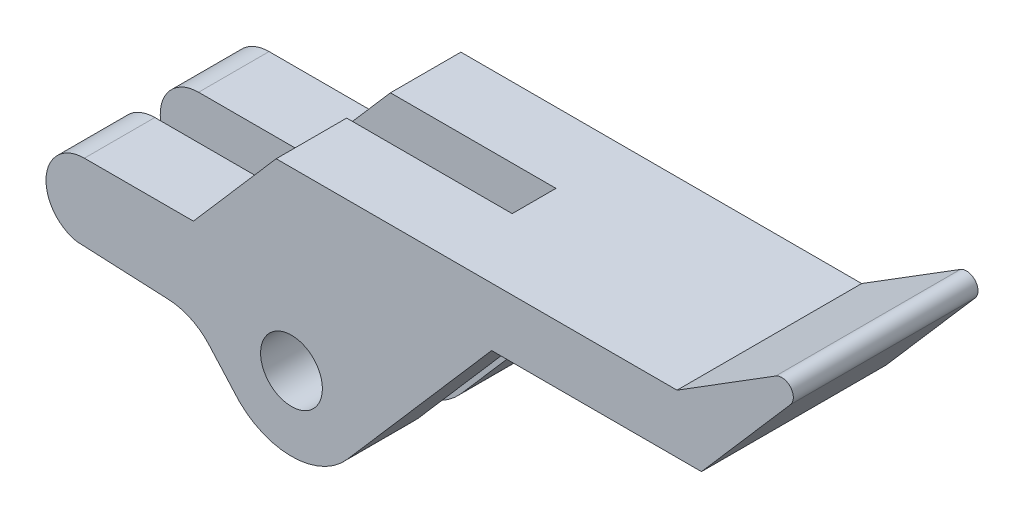
ISO-10303-21;
HEADER;
FILE_DESCRIPTION(('STEP AP214'),'2;1');
FILE_NAME('part.step','',(''),(''),'','','');
FILE_SCHEMA(('AUTOMOTIVE_DESIGN { 1 0 10303 214 1 1 1 1 }'));
ENDSEC;
DATA;
#1=APPLICATION_CONTEXT('core data for automotive mechanical design processes');
#2=APPLICATION_PROTOCOL_DEFINITION('international standard','automotive_design',2000,#1);
#3=PRODUCT_CONTEXT('',#1,'mechanical');
#4=PRODUCT('Part','Part','',(#3));
#5=PRODUCT_RELATED_PRODUCT_CATEGORY('part','',(#4));
#6=PRODUCT_DEFINITION_FORMATION('','',#4);
#7=PRODUCT_DEFINITION_CONTEXT('part definition',#1,'design');
#8=PRODUCT_DEFINITION('design','',#6,#7);
#9=PRODUCT_DEFINITION_SHAPE('','',#8);
#10=(LENGTH_UNIT() NAMED_UNIT(*) SI_UNIT(.MILLI.,.METRE.));
#11=(NAMED_UNIT(*) PLANE_ANGLE_UNIT() SI_UNIT($,.RADIAN.));
#12=(NAMED_UNIT(*) SI_UNIT($,.STERADIAN.) SOLID_ANGLE_UNIT());
#13=UNCERTAINTY_MEASURE_WITH_UNIT(LENGTH_MEASURE(1.E-05),#10,'distance_accuracy_value','');
#14=(GEOMETRIC_REPRESENTATION_CONTEXT(3) GLOBAL_UNCERTAINTY_ASSIGNED_CONTEXT((#13)) GLOBAL_UNIT_ASSIGNED_CONTEXT((#10,
#11,#12)) REPRESENTATION_CONTEXT('',''));
#15=CARTESIAN_POINT('',(0.,0.,0.));
#16=DIRECTION('',(0.,0.,1.));
#17=DIRECTION('',(1.,0.,0.));
#18=AXIS2_PLACEMENT_3D('',#15,#16,#17);
#19=CARTESIAN_POINT('',(-25.1917416131223,-4.97044105303234,9.62));
#20=DIRECTION('',(0.755386178272393,-0.655279880413728,0.));
#21=DIRECTION('',(0.655279880413728,0.755386178272393,0.));
#22=AXIS2_PLACEMENT_3D('',#19,#20,#21);
#23=PLANE('',#22);
#24=DIRECTION('',(0.,0.,-1.));
#25=VECTOR('',#24,1.);
#26=CARTESIAN_POINT('',(-20.88,0.,9.62));
#27=LINE('',#26,#25);
#28=CARTESIAN_POINT('',(-20.88,0.,9.62));
#29=VERTEX_POINT('',#28);
#30=CARTESIAN_POINT('',(-20.88,0.,5.95));
#31=VERTEX_POINT('',#30);
#32=EDGE_CURVE('E11',#29,#31,#27,.T.);
#33=ORIENTED_EDGE('',*,*,#32,.T.);
#34=DIRECTION('',(-0.655279880413728,-0.755386178272393,0.));
#35=VECTOR('',#34,1.);
#36=CARTESIAN_POINT('',(-25.1917416131223,-4.97044105303234,5.95));
#37=LINE('',#36,#35);
#38=CARTESIAN_POINT('',(-25.1917416131223,-4.97044105303234,5.95));
#39=VERTEX_POINT('',#38);
#40=EDGE_CURVE('E348',#31,#39,#37,.T.);
#41=ORIENTED_EDGE('',*,*,#40,.T.);
#42=DIRECTION('',(0.,0.,-1.));
#43=VECTOR('',#42,1.);
#44=CARTESIAN_POINT('',(-25.1917416131223,-4.97044105303234,9.62));
#45=LINE('',#44,#43);
#46=CARTESIAN_POINT('',(-25.1917416131223,-4.97044105303234,9.62));
#47=VERTEX_POINT('',#46);
#48=EDGE_CURVE('E277',#47,#39,#45,.T.);
#49=ORIENTED_EDGE('',*,*,#48,.F.);
#50=DIRECTION('',(-0.655279880413728,-0.755386178272393,0.));
#51=VECTOR('',#50,1.);
#52=CARTESIAN_POINT('',(-25.1917416131223,-4.97044105303234,9.62));
#53=LINE('',#52,#51);
#54=EDGE_CURVE('E123',#29,#47,#53,.T.);
#55=ORIENTED_EDGE('',*,*,#54,.F.);
#56=EDGE_LOOP('',(#33,#41,#49,#55));
#57=FACE_BOUND('',#56,.T.);
#58=ADVANCED_FACE('F41',(#57),#23,.F.);
#59=CARTESIAN_POINT('',(-30.8717416131223,-4.97044105303234,9.62));
#60=DIRECTION('',(0.,-1.,0.));
#61=DIRECTION('',(1.,0.,0.));
#62=AXIS2_PLACEMENT_3D('',#59,#60,#61);
#63=PLANE('',#62);
#64=ORIENTED_EDGE('',*,*,#48,.T.);
#65=DIRECTION('',(-1.,0.,0.));
#66=VECTOR('',#65,1.);
#67=CARTESIAN_POINT('',(-30.8717416131223,-4.97044105303234,5.95));
#68=LINE('',#67,#66);
#69=CARTESIAN_POINT('',(-30.8717416131223,-4.97044105303234,5.95));
#70=VERTEX_POINT('',#69);
#71=EDGE_CURVE('E344',#39,#70,#68,.T.);
#72=ORIENTED_EDGE('',*,*,#71,.T.);
#73=DIRECTION('',(0.,0.,-1.));
#74=VECTOR('',#73,1.);
#75=CARTESIAN_POINT('',(-30.8717416131223,-4.97044105303234,9.62));
#76=LINE('',#75,#74);
#77=CARTESIAN_POINT('',(-30.8717416131223,-4.97044105303234,9.62));
#78=VERTEX_POINT('',#77);
#79=EDGE_CURVE('E272',#78,#70,#76,.T.);
#80=ORIENTED_EDGE('',*,*,#79,.F.);
#81=DIRECTION('',(-1.,0.,0.));
#82=VECTOR('',#81,1.);
#83=CARTESIAN_POINT('',(-30.8717416131223,-4.97044105303234,9.62));
#84=LINE('',#83,#82);
#85=EDGE_CURVE('E363',#47,#78,#84,.T.);
#86=ORIENTED_EDGE('',*,*,#85,.F.);
#87=EDGE_LOOP('',(#64,#72,#80,#86));
#88=FACE_BOUND('',#87,.T.);
#89=ADVANCED_FACE('F407',(#88),#63,.F.);
#90=CARTESIAN_POINT('',(-30.8717416131223,-6.97044105303234,9.62));
#91=DIRECTION('',(0.,0.,-1.));
#92=DIRECTION('',(-1.,0.,0.));
#93=AXIS2_PLACEMENT_3D('',#90,#91,#92);
#94=CYLINDRICAL_SURFACE('',#93,2.);
#95=ORIENTED_EDGE('',*,*,#79,.T.);
#96=CARTESIAN_POINT('',(-30.8717416131223,-6.97044105303234,5.95));
#97=DIRECTION('',(0.,0.,1.));
#98=DIRECTION('',(0.,-1.,0.));
#99=AXIS2_PLACEMENT_3D('',#96,#97,#98);
#100=CIRCLE('',#99,2.);
#101=CARTESIAN_POINT('',(-31.2856587952111,-8.92714045927023,5.95));
#102=VERTEX_POINT('',#101);
#103=EDGE_CURVE('E340',#70,#102,#100,.T.);
#104=ORIENTED_EDGE('',*,*,#103,.T.);
#105=DIRECTION('',(0.,0.,-1.));
#106=VECTOR('',#105,1.);
#107=CARTESIAN_POINT('',(-31.2856587952111,-8.92714045927023,9.62));
#108=LINE('',#107,#106);
#109=CARTESIAN_POINT('',(-31.2856587952111,-8.92714045927023,9.62));
#110=VERTEX_POINT('',#109);
#111=EDGE_CURVE('E267',#110,#102,#108,.T.);
#112=ORIENTED_EDGE('',*,*,#111,.F.);
#113=CARTESIAN_POINT('',(-30.8717416131223,-6.97044105303234,9.62));
#114=DIRECTION('',(0.,0.,1.));
#115=DIRECTION('',(-1.,0.,0.));
#116=AXIS2_PLACEMENT_3D('',#113,#114,#115);
#117=CIRCLE('',#116,2.);
#118=EDGE_CURVE('E366',#78,#110,#117,.T.);
#119=ORIENTED_EDGE('',*,*,#118,.F.);
#120=EDGE_LOOP('',(#95,#104,#112,#119));
#121=FACE_BOUND('',#120,.T.);
#122=ADVANCED_FACE('F412',(#121),#94,.T.);
#123=CARTESIAN_POINT('',(-31.2856587952111,-8.92714045927023,9.62));
#124=DIRECTION('',(0.0468353778050424,0.998902621573224,0.));
#125=DIRECTION('',(-0.998902621573224,0.0468353778050424,0.));
#126=AXIS2_PLACEMENT_3D('',#123,#124,#125);
#127=PLANE('',#126);
#128=ORIENTED_EDGE('',*,*,#111,.T.);
#129=DIRECTION('',(0.998902621573224,-0.0468353778050424,0.));
#130=VECTOR('',#129,1.);
#131=CARTESIAN_POINT('',(-31.2856587952111,-8.92714045927023,5.95));
#132=LINE('',#131,#130);
#133=CARTESIAN_POINT('',(-26.4703643199752,-9.15291435466257,5.95));
#134=VERTEX_POINT('',#133);
#135=EDGE_CURVE('E336',#102,#134,#132,.T.);
#136=ORIENTED_EDGE('',*,*,#135,.T.);
#137=DIRECTION('',(0.,0.,-1.));
#138=VECTOR('',#137,1.);
#139=CARTESIAN_POINT('',(-26.4703643199752,-9.15291435466257,9.62));
#140=LINE('',#139,#138);
#141=CARTESIAN_POINT('',(-26.4703643199752,-9.15291435466257,9.62));
#142=VERTEX_POINT('',#141);
#143=EDGE_CURVE('E262',#142,#134,#140,.T.);
#144=ORIENTED_EDGE('',*,*,#143,.F.);
#145=DIRECTION('',(0.998902621573224,-0.0468353778050423,0.));
#146=VECTOR('',#145,1.);
#147=CARTESIAN_POINT('',(-31.2856587952111,-8.92714045927023,9.62));
#148=LINE('',#147,#146);
#149=EDGE_CURVE('E369',#110,#142,#148,.T.);
#150=ORIENTED_EDGE('',*,*,#149,.F.);
#151=EDGE_LOOP('',(#128,#136,#144,#150));
#152=FACE_BOUND('',#151,.T.);
#153=ADVANCED_FACE('F485',(#152),#127,.F.);
#154=CARTESIAN_POINT('',(-26.6108704533903,-12.1496222193822,9.62));
#155=DIRECTION('',(0.,0.,-1.));
#156=DIRECTION('',(-1.,0.,0.));
#157=AXIS2_PLACEMENT_3D('',#154,#155,#156);
#158=CYLINDRICAL_SURFACE('',#157,3.);
#159=ORIENTED_EDGE('',*,*,#143,.T.);
#160=CARTESIAN_POINT('',(-26.6108704533903,-12.1496222193822,5.95));
#161=DIRECTION('',(0.,0.,1.));
#162=DIRECTION('',(0.,-1.,0.));
#163=AXIS2_PLACEMENT_3D('',#160,#161,#162);
#164=CIRCLE('',#163,3.);
#165=CARTESIAN_POINT('',(-24.3701775872998,-10.1548050648914,5.95));
#166=VERTEX_POINT('',#165);
#167=EDGE_CURVE('E332',#134,#166,#164,.F.);
#168=ORIENTED_EDGE('',*,*,#167,.T.);
#169=DIRECTION('',(0.,0.,-1.));
#170=VECTOR('',#169,1.);
#171=CARTESIAN_POINT('',(-24.3701775872998,-10.1548050648914,9.62));
#172=LINE('',#171,#170);
#173=CARTESIAN_POINT('',(-24.3701775872998,-10.1548050648914,9.62));
#174=VERTEX_POINT('',#173);
#175=EDGE_CURVE('E257',#174,#166,#172,.T.);
#176=ORIENTED_EDGE('',*,*,#175,.F.);
#177=CARTESIAN_POINT('',(-26.6108704533903,-12.1496222193822,9.62));
#178=DIRECTION('',(0.,0.,-1.));
#179=DIRECTION('',(-1.,0.,0.));
#180=AXIS2_PLACEMENT_3D('',#177,#178,#179);
#181=CIRCLE('',#180,3.);
#182=EDGE_CURVE('E372',#142,#174,#181,.T.);
#183=ORIENTED_EDGE('',*,*,#182,.F.);
#184=EDGE_LOOP('',(#159,#168,#176,#183));
#185=FACE_BOUND('',#184,.T.);
#186=ADVANCED_FACE('F489',(#185),#158,.F.);
#187=CARTESIAN_POINT('',(-23.081545029954,-11.6022709500511,9.62));
#188=DIRECTION('',(0.746897622030191,0.664939051496937,0.));
#189=DIRECTION('',(-0.664939051496937,0.746897622030191,0.));
#190=AXIS2_PLACEMENT_3D('',#187,#188,#189);
#191=PLANE('',#190);
#192=ORIENTED_EDGE('',*,*,#175,.T.);
#193=DIRECTION('',(0.664939051496937,-0.746897622030191,0.));
#194=VECTOR('',#193,1.);
#195=CARTESIAN_POINT('',(-23.081545029954,-11.6022709500511,5.95));
#196=LINE('',#195,#194);
#197=CARTESIAN_POINT('',(-23.081545029954,-11.6022709500511,5.95));
#198=VERTEX_POINT('',#197);
#199=EDGE_CURVE('E328',#166,#198,#196,.T.);
#200=ORIENTED_EDGE('',*,*,#199,.T.);
#201=DIRECTION('',(0.,0.,-1.));
#202=VECTOR('',#201,1.);
#203=CARTESIAN_POINT('',(-23.081545029954,-11.6022709500511,9.62));
#204=LINE('',#203,#202);
#205=CARTESIAN_POINT('',(-23.081545029954,-11.6022709500511,9.62));
#206=VERTEX_POINT('',#205);
#207=EDGE_CURVE('E252',#206,#198,#204,.T.);
#208=ORIENTED_EDGE('',*,*,#207,.F.);
#209=DIRECTION('',(0.664939051496937,-0.746897622030191,0.));
#210=VECTOR('',#209,1.);
#211=CARTESIAN_POINT('',(-23.081545029954,-11.6022709500511,9.62));
#212=LINE('',#211,#210);
#213=EDGE_CURVE('E375',#174,#206,#212,.T.);
#214=ORIENTED_EDGE('',*,*,#213,.F.);
#215=EDGE_LOOP('',(#192,#200,#208,#214));
#216=FACE_BOUND('',#215,.T.);
#217=ADVANCED_FACE('F495',(#216),#191,.F.);
#218=CARTESIAN_POINT('',(-20.0842699298777,-9.17,9.62));
#219=DIRECTION('',(0.,0.,-1.));
#220=DIRECTION('',(-1.,0.,0.));
#221=AXIS2_PLACEMENT_3D('',#218,#219,#220);
#222=CYLINDRICAL_SURFACE('',#221,3.86);
#223=ORIENTED_EDGE('',*,*,#207,.T.);
#224=CARTESIAN_POINT('',(-20.0842699298777,-9.17,5.95));
#225=DIRECTION('',(0.,0.,1.));
#226=DIRECTION('',(0.,-1.,0.));
#227=AXIS2_PLACEMENT_3D('',#224,#225,#226);
#228=CIRCLE('',#227,3.86);
#229=CARTESIAN_POINT('',(-17.1684792817462,-11.699380338397,5.95));
#230=VERTEX_POINT('',#229);
#231=EDGE_CURVE('E324',#198,#230,#228,.T.);
#232=ORIENTED_EDGE('',*,*,#231,.T.);
#233=DIRECTION('',(0.,0.,-1.));
#234=VECTOR('',#233,1.);
#235=CARTESIAN_POINT('',(-17.1684792817462,-11.699380338397,9.62));
#236=LINE('',#235,#234);
#237=CARTESIAN_POINT('',(-17.1684792817462,-11.699380338397,9.62));
#238=VERTEX_POINT('',#237);
#239=EDGE_CURVE('E247',#238,#230,#236,.T.);
#240=ORIENTED_EDGE('',*,*,#239,.F.);
#241=CARTESIAN_POINT('',(-20.0842699298777,-9.17,9.62));
#242=DIRECTION('',(0.,0.,1.));
#243=DIRECTION('',(1.,0.,0.));
#244=AXIS2_PLACEMENT_3D('',#241,#242,#243);
#245=CIRCLE('',#244,3.86);
#246=EDGE_CURVE('E378',#206,#238,#245,.T.);
#247=ORIENTED_EDGE('',*,*,#246,.F.);
#248=EDGE_LOOP('',(#223,#232,#240,#247));
#249=FACE_BOUND('',#248,.T.);
#250=ADVANCED_FACE('F501',(#249),#222,.T.);
#251=CARTESIAN_POINT('',(-9.65666893120579,-3.04,9.62));
#252=DIRECTION('',(-0.755386178272393,0.655279880413727,0.));
#253=DIRECTION('',(-0.655279880413727,-0.755386178272393,0.));
#254=AXIS2_PLACEMENT_3D('',#251,#252,#253);
#255=PLANE('',#254);
#256=ORIENTED_EDGE('',*,*,#239,.T.);
#257=DIRECTION('',(-0.655279880413727,-0.755386178272393,0.));
#258=VECTOR('',#257,1.);
#259=CARTESIAN_POINT('',(-9.65666893120579,-3.04,5.95));
#260=LINE('',#259,#258);
#261=CARTESIAN_POINT('',(-9.65666893120579,-3.04,5.95));
#262=VERTEX_POINT('',#261);
#263=EDGE_CURVE('E295',#262,#230,#260,.T.);
#264=ORIENTED_EDGE('',*,*,#263,.F.);
#265=DIRECTION('',(0.,0.,-1.));
#266=VECTOR('',#265,1.);
#267=CARTESIAN_POINT('',(-9.65666893120579,-3.04,9.62));
#268=LINE('',#267,#266);
#269=CARTESIAN_POINT('',(-9.65666893120579,-3.04,9.62));
#270=VERTEX_POINT('',#269);
#271=EDGE_CURVE('E242',#270,#262,#268,.T.);
#272=ORIENTED_EDGE('',*,*,#271,.F.);
#273=DIRECTION('',(0.655279880413727,0.755386178272393,0.));
#274=VECTOR('',#273,1.);
#275=CARTESIAN_POINT('',(-9.65666893120579,-3.04,9.62));
#276=LINE('',#275,#274);
#277=EDGE_CURVE('E381',#238,#270,#276,.T.);
#278=ORIENTED_EDGE('',*,*,#277,.F.);
#279=EDGE_LOOP('',(#256,#264,#272,#278));
#280=FACE_BOUND('',#279,.T.);
#281=ADVANCED_FACE('F394',(#280),#255,.F.);
#282=CARTESIAN_POINT('',(-20.0842699298777,-9.17,9.62));
#283=DIRECTION('',(0.,0.,-1.));
#284=DIRECTION('',(-1.,0.,0.));
#285=AXIS2_PLACEMENT_3D('',#282,#283,#284);
#286=CYLINDRICAL_SURFACE('',#285,1.61);
#287=CARTESIAN_POINT('',(-20.0842699298777,-9.17,5.95));
#288=DIRECTION('',(0.,0.,1.));
#289=DIRECTION('',(0.,-1.,0.));
#290=AXIS2_PLACEMENT_3D('',#287,#288,#289);
#291=CIRCLE('',#290,1.61);
#292=CARTESIAN_POINT('',(-20.0842699298777,-10.78,5.95));
#293=VERTEX_POINT('',#292);
#294=EDGE_CURVE('E45',#293,#293,#291,.T.);
#295=ORIENTED_EDGE('',*,*,#294,.F.);
#296=EDGE_LOOP('',(#295));
#297=FACE_BOUND('',#296,.T.);
#298=CARTESIAN_POINT('',(-20.0842699298777,-9.17,9.62));
#299=DIRECTION('',(0.,0.,1.));
#300=DIRECTION('',(1.,0.,0.));
#301=AXIS2_PLACEMENT_3D('',#298,#299,#300);
#302=CIRCLE('',#301,1.61);
#303=CARTESIAN_POINT('',(-18.4742699298777,-9.17,9.62));
#304=VERTEX_POINT('',#303);
#305=EDGE_CURVE('E192',#304,#304,#302,.T.);
#306=ORIENTED_EDGE('',*,*,#305,.T.);
#307=EDGE_LOOP('',(#306));
#308=FACE_BOUND('',#307,.T.);
#309=ADVANCED_FACE('F391',(#297,#308),#286,.F.);
#310=CARTESIAN_POINT('',(5.4583513994612,2.7,9.62));
#311=DIRECTION('',(0.,0.,-1.));
#312=DIRECTION('',(-1.,0.,0.));
#313=AXIS2_PLACEMENT_3D('',#310,#311,#312);
#314=PLANE('',#313);
#315=DIRECTION('',(-1.,0.,0.));
#316=VECTOR('',#315,1.);
#317=CARTESIAN_POINT('',(-20.88,0.,9.62));
#318=LINE('',#317,#316);
#319=CARTESIAN_POINT('',(0.,0.,9.62));
#320=VERTEX_POINT('',#319);
#321=EDGE_CURVE('E234',#320,#29,#318,.T.);
#322=ORIENTED_EDGE('',*,*,#321,.T.);
#323=ORIENTED_EDGE('',*,*,#54,.T.);
#324=ORIENTED_EDGE('',*,*,#85,.T.);
#325=ORIENTED_EDGE('',*,*,#118,.T.);
#326=ORIENTED_EDGE('',*,*,#149,.T.);
#327=ORIENTED_EDGE('',*,*,#182,.T.);
#328=ORIENTED_EDGE('',*,*,#213,.T.);
#329=ORIENTED_EDGE('',*,*,#246,.T.);
#330=ORIENTED_EDGE('',*,*,#277,.T.);
#331=DIRECTION('',(1.,0.,0.));
#332=VECTOR('',#331,1.);
#333=CARTESIAN_POINT('',(1.27333106879422,-3.04,9.62));
#334=LINE('',#333,#332);
#335=CARTESIAN_POINT('',(1.27333106879422,-3.04,9.62));
#336=VERTEX_POINT('',#335);
#337=EDGE_CURVE('E162',#270,#336,#334,.T.);
#338=ORIENTED_EDGE('',*,*,#337,.T.);
#339=DIRECTION('',(0.655279880413727,0.755386178272393,0.));
#340=VECTOR('',#339,1.);
#341=CARTESIAN_POINT('',(5.91158310642463,2.30683207175176,9.62));
#342=LINE('',#341,#340);
#343=CARTESIAN_POINT('',(5.91158310642463,2.30683207175176,9.62));
#344=VERTEX_POINT('',#343);
#345=EDGE_CURVE('E154',#336,#344,#342,.T.);
#346=ORIENTED_EDGE('',*,*,#345,.T.);
#347=CARTESIAN_POINT('',(5.4583513994612,2.7,9.62));
#348=DIRECTION('',(0.,0.,1.));
#349=DIRECTION('',(-1.,0.,0.));
#350=AXIS2_PLACEMENT_3D('',#347,#348,#349);
#351=CIRCLE('',#350,0.599999999999999);
#352=CARTESIAN_POINT('',(5.14063126161573,3.20897339223918,9.62));
#353=VERTEX_POINT('',#352);
#354=EDGE_CURVE('E159',#344,#353,#351,.T.);
#355=ORIENTED_EDGE('',*,*,#354,.T.);
#356=DIRECTION('',(-0.848288987065303,-0.529533563075772,0.));
#357=VECTOR('',#356,1.);
#358=CARTESIAN_POINT('',(0.,0.,9.62));
#359=LINE('',#358,#357);
#360=EDGE_CURVE('E68',#353,#320,#359,.T.);
#361=ORIENTED_EDGE('',*,*,#360,.T.);
#362=EDGE_LOOP('',(#322,#323,#324,#325,#326,#327,#328,#329,#330,#338,#346,#355,#361));
#363=FACE_BOUND('',#362,.T.);
#364=ORIENTED_EDGE('',*,*,#305,.F.);
#365=EDGE_LOOP('',(#364));
#366=FACE_BOUND('',#365,.T.);
#367=ADVANCED_FACE('F156',(#363,#366),#314,.F.);
#368=CARTESIAN_POINT('',(5.4583513994612,2.7,0.));
#369=DIRECTION('',(0.,0.,-1.));
#370=DIRECTION('',(-1.,0.,0.));
#371=AXIS2_PLACEMENT_3D('',#368,#369,#370);
#372=PLANE('',#371);
#373=DIRECTION('',(-1.,0.,0.));
#374=VECTOR('',#373,1.);
#375=CARTESIAN_POINT('',(-20.88,0.,0.));
#376=LINE('',#375,#374);
#377=CARTESIAN_POINT('',(0.,0.,0.));
#378=VERTEX_POINT('',#377);
#379=CARTESIAN_POINT('',(-20.88,0.,0.));
#380=VERTEX_POINT('',#379);
#381=EDGE_CURVE('E187',#378,#380,#376,.T.);
#382=ORIENTED_EDGE('',*,*,#381,.F.);
#383=DIRECTION('',(-0.848288987065303,-0.529533563075772,0.));
#384=VECTOR('',#383,1.);
#385=CARTESIAN_POINT('',(0.,0.,0.));
#386=LINE('',#385,#384);
#387=CARTESIAN_POINT('',(5.14063126161573,3.20897339223918,0.));
#388=VERTEX_POINT('',#387);
#389=EDGE_CURVE('E115',#388,#378,#386,.T.);
#390=ORIENTED_EDGE('',*,*,#389,.F.);
#391=CARTESIAN_POINT('',(5.4583513994612,2.7,0.));
#392=DIRECTION('',(0.,0.,1.));
#393=DIRECTION('',(-1.,0.,0.));
#394=AXIS2_PLACEMENT_3D('',#391,#392,#393);
#395=CIRCLE('',#394,0.599999999999999);
#396=CARTESIAN_POINT('',(5.91158310642463,2.30683207175176,0.));
#397=VERTEX_POINT('',#396);
#398=EDGE_CURVE('E229',#397,#388,#395,.T.);
#399=ORIENTED_EDGE('',*,*,#398,.F.);
#400=DIRECTION('',(0.655279880413727,0.755386178272393,0.));
#401=VECTOR('',#400,1.);
#402=CARTESIAN_POINT('',(5.91158310642463,2.30683207175176,0.));
#403=LINE('',#402,#401);
#404=CARTESIAN_POINT('',(1.27333106879422,-3.04,0.));
#405=VERTEX_POINT('',#404);
#406=EDGE_CURVE('E172',#405,#397,#403,.T.);
#407=ORIENTED_EDGE('',*,*,#406,.F.);
#408=DIRECTION('',(1.,0.,0.));
#409=VECTOR('',#408,1.);
#410=CARTESIAN_POINT('',(1.27333106879422,-3.04,0.));
#411=LINE('',#410,#409);
#412=CARTESIAN_POINT('',(-9.65666893120579,-3.04,0.));
#413=VERTEX_POINT('',#412);
#414=EDGE_CURVE('E224',#413,#405,#411,.T.);
#415=ORIENTED_EDGE('',*,*,#414,.F.);
#416=DIRECTION('',(0.655279880413727,0.755386178272393,0.));
#417=VECTOR('',#416,1.);
#418=CARTESIAN_POINT('',(-9.65666893120579,-3.04,0.));
#419=LINE('',#418,#417);
#420=CARTESIAN_POINT('',(-17.1684792817462,-11.699380338397,0.));
#421=VERTEX_POINT('',#420);
#422=EDGE_CURVE('E220',#421,#413,#419,.T.);
#423=ORIENTED_EDGE('',*,*,#422,.F.);
#424=CARTESIAN_POINT('',(-20.0842699298777,-9.17,0.));
#425=DIRECTION('',(0.,0.,1.));
#426=DIRECTION('',(1.,0.,0.));
#427=AXIS2_PLACEMENT_3D('',#424,#425,#426);
#428=CIRCLE('',#427,3.86);
#429=CARTESIAN_POINT('',(-23.081545029954,-11.6022709500511,0.));
#430=VERTEX_POINT('',#429);
#431=EDGE_CURVE('E216',#430,#421,#428,.T.);
#432=ORIENTED_EDGE('',*,*,#431,.F.);
#433=DIRECTION('',(0.664939051496937,-0.746897622030191,0.));
#434=VECTOR('',#433,1.);
#435=CARTESIAN_POINT('',(-23.081545029954,-11.6022709500511,0.));
#436=LINE('',#435,#434);
#437=CARTESIAN_POINT('',(-24.3701775872998,-10.1548050648914,0.));
#438=VERTEX_POINT('',#437);
#439=EDGE_CURVE('E212',#438,#430,#436,.T.);
#440=ORIENTED_EDGE('',*,*,#439,.F.);
#441=CARTESIAN_POINT('',(-26.6108704533903,-12.1496222193822,0.));
#442=DIRECTION('',(0.,0.,-1.));
#443=DIRECTION('',(-1.,0.,0.));
#444=AXIS2_PLACEMENT_3D('',#441,#442,#443);
#445=CIRCLE('',#444,3.);
#446=CARTESIAN_POINT('',(-26.4703643199752,-9.15291435466257,0.));
#447=VERTEX_POINT('',#446);
#448=EDGE_CURVE('E208',#447,#438,#445,.T.);
#449=ORIENTED_EDGE('',*,*,#448,.F.);
#450=DIRECTION('',(0.998902621573224,-0.0468353778050423,0.));
#451=VECTOR('',#450,1.);
#452=CARTESIAN_POINT('',(-31.2856587952111,-8.92714045927023,0.));
#453=LINE('',#452,#451);
#454=CARTESIAN_POINT('',(-31.2856587952111,-8.92714045927023,0.));
#455=VERTEX_POINT('',#454);
#456=EDGE_CURVE('E204',#455,#447,#453,.T.);
#457=ORIENTED_EDGE('',*,*,#456,.F.);
#458=CARTESIAN_POINT('',(-30.8717416131223,-6.97044105303234,0.));
#459=DIRECTION('',(0.,0.,1.));
#460=DIRECTION('',(-1.,0.,0.));
#461=AXIS2_PLACEMENT_3D('',#458,#459,#460);
#462=CIRCLE('',#461,2.);
#463=CARTESIAN_POINT('',(-30.8717416131223,-4.97044105303234,0.));
#464=VERTEX_POINT('',#463);
#465=EDGE_CURVE('E200',#464,#455,#462,.T.);
#466=ORIENTED_EDGE('',*,*,#465,.F.);
#467=DIRECTION('',(-1.,0.,0.));
#468=VECTOR('',#467,1.);
#469=CARTESIAN_POINT('',(-30.8717416131223,-4.97044105303234,0.));
#470=LINE('',#469,#468);
#471=CARTESIAN_POINT('',(-25.1917416131223,-4.97044105303234,0.));
#472=VERTEX_POINT('',#471);
#473=EDGE_CURVE('E196',#472,#464,#470,.T.);
#474=ORIENTED_EDGE('',*,*,#473,.F.);
#475=DIRECTION('',(-0.655279880413728,-0.755386178272393,0.));
#476=VECTOR('',#475,1.);
#477=CARTESIAN_POINT('',(-25.1917416131223,-4.97044105303234,0.));
#478=LINE('',#477,#476);
#479=EDGE_CURVE('E191',#380,#472,#478,.T.);
#480=ORIENTED_EDGE('',*,*,#479,.F.);
#481=EDGE_LOOP('',(#382,#390,#399,#407,#415,#423,#432,#440,#449,#457,#466,#474,#480));
#482=FACE_BOUND('',#481,.T.);
#483=CARTESIAN_POINT('',(-20.0842699298777,-9.17,0.));
#484=DIRECTION('',(0.,0.,1.));
#485=DIRECTION('',(1.,0.,0.));
#486=AXIS2_PLACEMENT_3D('',#483,#484,#485);
#487=CIRCLE('',#486,1.61);
#488=CARTESIAN_POINT('',(-18.4742699298777,-9.17,0.));
#489=VERTEX_POINT('',#488);
#490=EDGE_CURVE('E352',#489,#489,#487,.T.);
#491=ORIENTED_EDGE('',*,*,#490,.T.);
#492=EDGE_LOOP('',(#491));
#493=FACE_BOUND('',#492,.T.);
#494=ADVANCED_FACE('F399',(#482,#493),#372,.T.);
#495=CARTESIAN_POINT('',(-20.88,0.,9.62));
#496=DIRECTION('',(0.,-1.,0.));
#497=DIRECTION('',(0.,0.,-1.));
#498=AXIS2_PLACEMENT_3D('',#495,#496,#497);
#499=PLANE('',#498);
#500=DIRECTION('',(0.,0.,-1.));
#501=VECTOR('',#500,1.);
#502=CARTESIAN_POINT('',(-12.2566689312058,0.,5.95));
#503=LINE('',#502,#501);
#504=CARTESIAN_POINT('',(-12.2566689312058,0.,5.95));
#505=VERTEX_POINT('',#504);
#506=CARTESIAN_POINT('',(-12.2566689312058,0.,3.67));
#507=VERTEX_POINT('',#506);
#508=EDGE_CURVE('E543',#505,#507,#503,.T.);
#509=ORIENTED_EDGE('',*,*,#508,.F.);
#510=DIRECTION('',(1.,0.,0.));
#511=VECTOR('',#510,1.);
#512=CARTESIAN_POINT('',(-23.5171290523394,0.,5.95));
#513=LINE('',#512,#511);
#514=EDGE_CURVE('E446',#31,#505,#513,.T.);
#515=ORIENTED_EDGE('',*,*,#514,.F.);
#516=ORIENTED_EDGE('',*,*,#32,.F.);
#517=ORIENTED_EDGE('',*,*,#321,.F.);
#518=DIRECTION('',(0.,0.,-1.));
#519=VECTOR('',#518,1.);
#520=CARTESIAN_POINT('',(0.,0.,9.62));
#521=LINE('',#520,#519);
#522=EDGE_CURVE('E183',#320,#378,#521,.T.);
#523=ORIENTED_EDGE('',*,*,#522,.T.);
#524=ORIENTED_EDGE('',*,*,#381,.T.);
#525=CARTESIAN_POINT('',(-20.88,0.,3.67));
#526=VERTEX_POINT('',#525);
#527=EDGE_CURVE('E51',#526,#380,#27,.T.);
#528=ORIENTED_EDGE('',*,*,#527,.F.);
#529=DIRECTION('',(-1.,0.,0.));
#530=VECTOR('',#529,1.);
#531=CARTESIAN_POINT('',(-23.5171290523394,0.,3.67));
#532=LINE('',#531,#530);
#533=EDGE_CURVE('E439',#507,#526,#532,.T.);
#534=ORIENTED_EDGE('',*,*,#533,.F.);
#535=EDGE_LOOP('',(#509,#515,#516,#517,#523,#524,#528,#534));
#536=FACE_BOUND('',#535,.T.);
#537=ADVANCED_FACE('F43',(#536),#499,.F.);
#538=DIRECTION('',(0.655279880413728,0.755386178272393,0.));
#539=VECTOR('',#538,1.);
#540=CARTESIAN_POINT('',(-25.1917416131223,-4.97044105303234,3.67));
#541=LINE('',#540,#539);
#542=CARTESIAN_POINT('',(-25.1917416131223,-4.97044105303234,3.67));
#543=VERTEX_POINT('',#542);
#544=EDGE_CURVE('E320',#543,#526,#541,.T.);
#545=ORIENTED_EDGE('',*,*,#544,.T.);
#546=ORIENTED_EDGE('',*,*,#527,.T.);
#547=ORIENTED_EDGE('',*,*,#479,.T.);
#548=EDGE_CURVE('E276',#543,#472,#45,.T.);
#549=ORIENTED_EDGE('',*,*,#548,.F.);
#550=EDGE_LOOP('',(#545,#546,#547,#549));
#551=FACE_BOUND('',#550,.T.);
#552=ADVANCED_FACE('F408',(#551),#23,.F.);
#553=CARTESIAN_POINT('',(-30.8717416131223,-4.97044105303234,3.67));
#554=VERTEX_POINT('',#553);
#555=EDGE_CURVE('E271',#554,#464,#76,.T.);
#556=ORIENTED_EDGE('',*,*,#555,.F.);
#557=DIRECTION('',(1.,0.,0.));
#558=VECTOR('',#557,1.);
#559=CARTESIAN_POINT('',(-30.8717416131223,-4.97044105303234,3.67));
#560=LINE('',#559,#558);
#561=EDGE_CURVE('E316',#554,#543,#560,.T.);
#562=ORIENTED_EDGE('',*,*,#561,.T.);
#563=ORIENTED_EDGE('',*,*,#548,.T.);
#564=ORIENTED_EDGE('',*,*,#473,.T.);
#565=EDGE_LOOP('',(#556,#562,#563,#564));
#566=FACE_BOUND('',#565,.T.);
#567=ADVANCED_FACE('F415',(#566),#63,.F.);
#568=CARTESIAN_POINT('',(-31.2856587952111,-8.92714045927023,3.67));
#569=VERTEX_POINT('',#568);
#570=EDGE_CURVE('E266',#569,#455,#108,.T.);
#571=ORIENTED_EDGE('',*,*,#570,.F.);
#572=CARTESIAN_POINT('',(-30.8717416131223,-6.97044105303234,3.67));
#573=DIRECTION('',(0.,0.,-1.));
#574=DIRECTION('',(0.,1.,0.));
#575=AXIS2_PLACEMENT_3D('',#572,#573,#574);
#576=CIRCLE('',#575,2.);
#577=EDGE_CURVE('E312',#569,#554,#576,.T.);
#578=ORIENTED_EDGE('',*,*,#577,.T.);
#579=ORIENTED_EDGE('',*,*,#555,.T.);
#580=ORIENTED_EDGE('',*,*,#465,.T.);
#581=EDGE_LOOP('',(#571,#578,#579,#580));
#582=FACE_BOUND('',#581,.T.);
#583=ADVANCED_FACE('F422',(#582),#94,.T.);
#584=CARTESIAN_POINT('',(-26.4703643199752,-9.15291435466257,3.67));
#585=VERTEX_POINT('',#584);
#586=EDGE_CURVE('E261',#585,#447,#140,.T.);
#587=ORIENTED_EDGE('',*,*,#586,.F.);
#588=DIRECTION('',(-0.998902621573224,0.0468353778050424,0.));
#589=VECTOR('',#588,1.);
#590=CARTESIAN_POINT('',(-31.2856587952111,-8.92714045927023,3.67));
#591=LINE('',#590,#589);
#592=EDGE_CURVE('E308',#585,#569,#591,.T.);
#593=ORIENTED_EDGE('',*,*,#592,.T.);
#594=ORIENTED_EDGE('',*,*,#570,.T.);
#595=ORIENTED_EDGE('',*,*,#456,.T.);
#596=EDGE_LOOP('',(#587,#593,#594,#595));
#597=FACE_BOUND('',#596,.T.);
#598=ADVANCED_FACE('F573',(#597),#127,.F.);
#599=CARTESIAN_POINT('',(-24.3701775872998,-10.1548050648914,3.67));
#600=VERTEX_POINT('',#599);
#601=EDGE_CURVE('E256',#600,#438,#172,.T.);
#602=ORIENTED_EDGE('',*,*,#601,.F.);
#603=CARTESIAN_POINT('',(-26.6108704533903,-12.1496222193822,3.67));
#604=DIRECTION('',(0.,0.,-1.));
#605=DIRECTION('',(0.,1.,0.));
#606=AXIS2_PLACEMENT_3D('',#603,#604,#605);
#607=CIRCLE('',#606,3.);
#608=EDGE_CURVE('E304',#600,#585,#607,.F.);
#609=ORIENTED_EDGE('',*,*,#608,.T.);
#610=ORIENTED_EDGE('',*,*,#586,.T.);
#611=ORIENTED_EDGE('',*,*,#448,.T.);
#612=EDGE_LOOP('',(#602,#609,#610,#611));
#613=FACE_BOUND('',#612,.T.);
#614=ADVANCED_FACE('F570',(#613),#158,.F.);
#615=CARTESIAN_POINT('',(-23.081545029954,-11.6022709500511,3.67));
#616=VERTEX_POINT('',#615);
#617=EDGE_CURVE('E251',#616,#430,#204,.T.);
#618=ORIENTED_EDGE('',*,*,#617,.F.);
#619=DIRECTION('',(-0.664939051496937,0.746897622030191,0.));
#620=VECTOR('',#619,1.);
#621=CARTESIAN_POINT('',(-23.081545029954,-11.6022709500511,3.67));
#622=LINE('',#621,#620);
#623=EDGE_CURVE('E289',#616,#600,#622,.T.);
#624=ORIENTED_EDGE('',*,*,#623,.T.);
#625=ORIENTED_EDGE('',*,*,#601,.T.);
#626=ORIENTED_EDGE('',*,*,#439,.T.);
#627=EDGE_LOOP('',(#618,#624,#625,#626));
#628=FACE_BOUND('',#627,.T.);
#629=ADVANCED_FACE('F567',(#628),#191,.F.);
#630=CARTESIAN_POINT('',(-17.1684792817462,-11.699380338397,3.67));
#631=VERTEX_POINT('',#630);
#632=EDGE_CURVE('E246',#631,#421,#236,.T.);
#633=ORIENTED_EDGE('',*,*,#632,.F.);
#634=CARTESIAN_POINT('',(-20.0842699298777,-9.17,3.67));
#635=DIRECTION('',(0.,0.,-1.));
#636=DIRECTION('',(0.,1.,0.));
#637=AXIS2_PLACEMENT_3D('',#634,#635,#636);
#638=CIRCLE('',#637,3.86);
#639=EDGE_CURVE('E283',#631,#616,#638,.T.);
#640=ORIENTED_EDGE('',*,*,#639,.T.);
#641=ORIENTED_EDGE('',*,*,#617,.T.);
#642=ORIENTED_EDGE('',*,*,#431,.T.);
#643=EDGE_LOOP('',(#633,#640,#641,#642));
#644=FACE_BOUND('',#643,.T.);
#645=ADVANCED_FACE('F561',(#644),#222,.T.);
#646=CARTESIAN_POINT('',(-9.65666893120579,-3.04,3.67));
#647=VERTEX_POINT('',#646);
#648=EDGE_CURVE('E241',#647,#413,#268,.T.);
#649=ORIENTED_EDGE('',*,*,#648,.F.);
#650=DIRECTION('',(0.655279880413727,0.755386178272393,0.));
#651=VECTOR('',#650,1.);
#652=CARTESIAN_POINT('',(-9.65666893120579,-3.04,3.67));
#653=LINE('',#652,#651);
#654=EDGE_CURVE('E298',#631,#647,#653,.T.);
#655=ORIENTED_EDGE('',*,*,#654,.F.);
#656=ORIENTED_EDGE('',*,*,#632,.T.);
#657=ORIENTED_EDGE('',*,*,#422,.T.);
#658=EDGE_LOOP('',(#649,#655,#656,#657));
#659=FACE_BOUND('',#658,.T.);
#660=ADVANCED_FACE('F464',(#659),#255,.F.);
#661=CARTESIAN_POINT('',(1.27333106879422,-3.04,9.62));
#662=DIRECTION('',(0.,1.,0.));
#663=DIRECTION('',(0.,0.,1.));
#664=AXIS2_PLACEMENT_3D('',#661,#662,#663);
#665=PLANE('',#664);
#666=DIRECTION('',(-1.,0.,0.));
#667=VECTOR('',#666,1.);
#668=CARTESIAN_POINT('',(-36.1971914301363,-3.04,5.95));
#669=LINE('',#668,#667);
#670=CARTESIAN_POINT('',(-12.2566689312058,-3.04,5.95));
#671=VERTEX_POINT('',#670);
#672=EDGE_CURVE('E291',#262,#671,#669,.T.);
#673=ORIENTED_EDGE('',*,*,#672,.T.);
#674=DIRECTION('',(0.,0.,1.));
#675=VECTOR('',#674,1.);
#676=CARTESIAN_POINT('',(-12.2566689312058,-3.04,5.95));
#677=LINE('',#676,#675);
#678=CARTESIAN_POINT('',(-12.2566689312058,-3.04,3.67));
#679=VERTEX_POINT('',#678);
#680=EDGE_CURVE('E550',#679,#671,#677,.T.);
#681=ORIENTED_EDGE('',*,*,#680,.F.);
#682=DIRECTION('',(1.,0.,0.));
#683=VECTOR('',#682,1.);
#684=CARTESIAN_POINT('',(-36.1971914301363,-3.04,3.67));
#685=LINE('',#684,#683);
#686=EDGE_CURVE('E59',#679,#647,#685,.T.);
#687=ORIENTED_EDGE('',*,*,#686,.T.);
#688=ORIENTED_EDGE('',*,*,#648,.T.);
#689=ORIENTED_EDGE('',*,*,#414,.T.);
#690=DIRECTION('',(0.,0.,-1.));
#691=VECTOR('',#690,1.);
#692=CARTESIAN_POINT('',(1.27333106879422,-3.04,9.62));
#693=LINE('',#692,#691);
#694=EDGE_CURVE('E176',#336,#405,#693,.T.);
#695=ORIENTED_EDGE('',*,*,#694,.F.);
#696=ORIENTED_EDGE('',*,*,#337,.F.);
#697=ORIENTED_EDGE('',*,*,#271,.T.);
#698=EDGE_LOOP('',(#673,#681,#687,#688,#689,#695,#696,#697));
#699=FACE_BOUND('',#698,.T.);
#700=ADVANCED_FACE('F459',(#699),#665,.F.);
#701=CARTESIAN_POINT('',(5.91158310642463,2.30683207175176,9.62));
#702=DIRECTION('',(-0.755386178272393,0.655279880413727,0.));
#703=DIRECTION('',(-0.655279880413727,-0.755386178272393,0.));
#704=AXIS2_PLACEMENT_3D('',#701,#702,#703);
#705=PLANE('',#704);
#706=ORIENTED_EDGE('',*,*,#406,.T.);
#707=DIRECTION('',(0.,0.,-1.));
#708=VECTOR('',#707,1.);
#709=CARTESIAN_POINT('',(5.91158310642463,2.30683207175176,9.62));
#710=LINE('',#709,#708);
#711=EDGE_CURVE('E169',#344,#397,#710,.T.);
#712=ORIENTED_EDGE('',*,*,#711,.F.);
#713=ORIENTED_EDGE('',*,*,#345,.F.);
#714=ORIENTED_EDGE('',*,*,#694,.T.);
#715=EDGE_LOOP('',(#706,#712,#713,#714));
#716=FACE_BOUND('',#715,.T.);
#717=ADVANCED_FACE('F170',(#716),#705,.F.);
#718=CARTESIAN_POINT('',(5.4583513994612,2.7,9.62));
#719=DIRECTION('',(0.,0.,-1.));
#720=DIRECTION('',(-1.,0.,0.));
#721=AXIS2_PLACEMENT_3D('',#718,#719,#720);
#722=CYLINDRICAL_SURFACE('',#721,0.599999999999999);
#723=ORIENTED_EDGE('',*,*,#398,.T.);
#724=DIRECTION('',(0.,0.,-1.));
#725=VECTOR('',#724,1.);
#726=CARTESIAN_POINT('',(5.14063126161573,3.20897339223918,9.62));
#727=LINE('',#726,#725);
#728=EDGE_CURVE('E177',#353,#388,#727,.T.);
#729=ORIENTED_EDGE('',*,*,#728,.F.);
#730=ORIENTED_EDGE('',*,*,#354,.F.);
#731=ORIENTED_EDGE('',*,*,#711,.T.);
#732=EDGE_LOOP('',(#723,#729,#730,#731));
#733=FACE_BOUND('',#732,.T.);
#734=ADVANCED_FACE('F179',(#733),#722,.T.);
#735=CARTESIAN_POINT('',(0.,0.,9.62));
#736=DIRECTION('',(0.529533563075772,-0.848288987065303,0.));
#737=DIRECTION('',(0.848288987065303,0.529533563075772,0.));
#738=AXIS2_PLACEMENT_3D('',#735,#736,#737);
#739=PLANE('',#738);
#740=ORIENTED_EDGE('',*,*,#389,.T.);
#741=ORIENTED_EDGE('',*,*,#522,.F.);
#742=ORIENTED_EDGE('',*,*,#360,.F.);
#743=ORIENTED_EDGE('',*,*,#728,.T.);
#744=EDGE_LOOP('',(#740,#741,#742,#743));
#745=FACE_BOUND('',#744,.T.);
#746=ADVANCED_FACE('F468',(#745),#739,.F.);
#747=CARTESIAN_POINT('',(-20.0842699298777,-9.17,3.67));
#748=DIRECTION('',(0.,0.,-1.));
#749=DIRECTION('',(0.,1.,0.));
#750=AXIS2_PLACEMENT_3D('',#747,#748,#749);
#751=CIRCLE('',#750,1.61);
#752=CARTESIAN_POINT('',(-20.0842699298777,-7.56,3.67));
#753=VERTEX_POINT('',#752);
#754=EDGE_CURVE('E280',#753,#753,#751,.T.);
#755=ORIENTED_EDGE('',*,*,#754,.F.);
#756=EDGE_LOOP('',(#755));
#757=FACE_BOUND('',#756,.T.);
#758=ORIENTED_EDGE('',*,*,#490,.F.);
#759=EDGE_LOOP('',(#758));
#760=FACE_BOUND('',#759,.T.);
#761=ADVANCED_FACE('F396',(#757,#760),#286,.F.);
#762=CARTESIAN_POINT('',(-36.1971914301363,19.9832838638803,5.95));
#763=DIRECTION('',(0.,0.,1.));
#764=DIRECTION('',(0.,-1.,0.));
#765=AXIS2_PLACEMENT_3D('',#762,#763,#764);
#766=PLANE('',#765);
#767=ORIENTED_EDGE('',*,*,#294,.T.);
#768=EDGE_LOOP('',(#767));
#769=FACE_BOUND('',#768,.T.);
#770=ORIENTED_EDGE('',*,*,#672,.F.);
#771=ORIENTED_EDGE('',*,*,#263,.T.);
#772=ORIENTED_EDGE('',*,*,#231,.F.);
#773=ORIENTED_EDGE('',*,*,#199,.F.);
#774=ORIENTED_EDGE('',*,*,#167,.F.);
#775=ORIENTED_EDGE('',*,*,#135,.F.);
#776=ORIENTED_EDGE('',*,*,#103,.F.);
#777=ORIENTED_EDGE('',*,*,#71,.F.);
#778=ORIENTED_EDGE('',*,*,#40,.F.);
#779=ORIENTED_EDGE('',*,*,#514,.T.);
#780=DIRECTION('',(0.,-1.,0.));
#781=VECTOR('',#780,1.);
#782=CARTESIAN_POINT('',(-12.2566689312058,11.4889669744342,5.95));
#783=LINE('',#782,#781);
#784=EDGE_CURVE('E547',#505,#671,#783,.T.);
#785=ORIENTED_EDGE('',*,*,#784,.T.);
#786=EDGE_LOOP('',(#770,#771,#772,#773,#774,#775,#776,#777,#778,#779,#785));
#787=FACE_BOUND('',#786,.T.);
#788=ADVANCED_FACE('F388',(#769,#787),#766,.F.);
#789=CARTESIAN_POINT('',(-36.1971914301363,19.9832838638803,3.67));
#790=DIRECTION('',(0.,0.,-1.));
#791=DIRECTION('',(0.,1.,0.));
#792=AXIS2_PLACEMENT_3D('',#789,#790,#791);
#793=PLANE('',#792);
#794=ORIENTED_EDGE('',*,*,#754,.T.);
#795=EDGE_LOOP('',(#794));
#796=FACE_BOUND('',#795,.T.);
#797=ORIENTED_EDGE('',*,*,#561,.F.);
#798=ORIENTED_EDGE('',*,*,#577,.F.);
#799=ORIENTED_EDGE('',*,*,#592,.F.);
#800=ORIENTED_EDGE('',*,*,#608,.F.);
#801=ORIENTED_EDGE('',*,*,#623,.F.);
#802=ORIENTED_EDGE('',*,*,#639,.F.);
#803=ORIENTED_EDGE('',*,*,#654,.T.);
#804=ORIENTED_EDGE('',*,*,#686,.F.);
#805=DIRECTION('',(0.,-1.,0.));
#806=VECTOR('',#805,1.);
#807=CARTESIAN_POINT('',(-12.2566689312058,11.4889669744342,3.67));
#808=LINE('',#807,#806);
#809=EDGE_CURVE('E443',#507,#679,#808,.T.);
#810=ORIENTED_EDGE('',*,*,#809,.F.);
#811=ORIENTED_EDGE('',*,*,#533,.T.);
#812=ORIENTED_EDGE('',*,*,#544,.F.);
#813=EDGE_LOOP('',(#797,#798,#799,#800,#801,#802,#803,#804,#810,#811,#812));
#814=FACE_BOUND('',#813,.T.);
#815=ADVANCED_FACE('F440',(#796,#814),#793,.F.);
#816=CARTESIAN_POINT('',(-12.2566689312058,11.4889669744342,5.95));
#817=DIRECTION('',(1.,0.,0.));
#818=DIRECTION('',(0.,0.,-1.));
#819=AXIS2_PLACEMENT_3D('',#816,#817,#818);
#820=PLANE('',#819);
#821=ORIENTED_EDGE('',*,*,#508,.T.);
#822=ORIENTED_EDGE('',*,*,#809,.T.);
#823=ORIENTED_EDGE('',*,*,#680,.T.);
#824=ORIENTED_EDGE('',*,*,#784,.F.);
#825=EDGE_LOOP('',(#821,#822,#823,#824));
#826=FACE_BOUND('',#825,.T.);
#827=ADVANCED_FACE('F620',(#826),#820,.F.);
#828=CLOSED_SHELL('',(#58,#89,#122,#153,#186,#217,#250,#281,#309,#367,#494,#537,#552,#567,#583,
#598,#614,#629,#645,#660,#700,#717,#734,#746,#761,#788,#815,#827));
#829=MANIFOLD_SOLID_BREP('B2',#828);
#830=ADVANCED_BREP_SHAPE_REPRESENTATION('',(#18,#829),#14);
#831=SHAPE_DEFINITION_REPRESENTATION(#9,#830);
ENDSEC;
END-ISO-10303-21;
